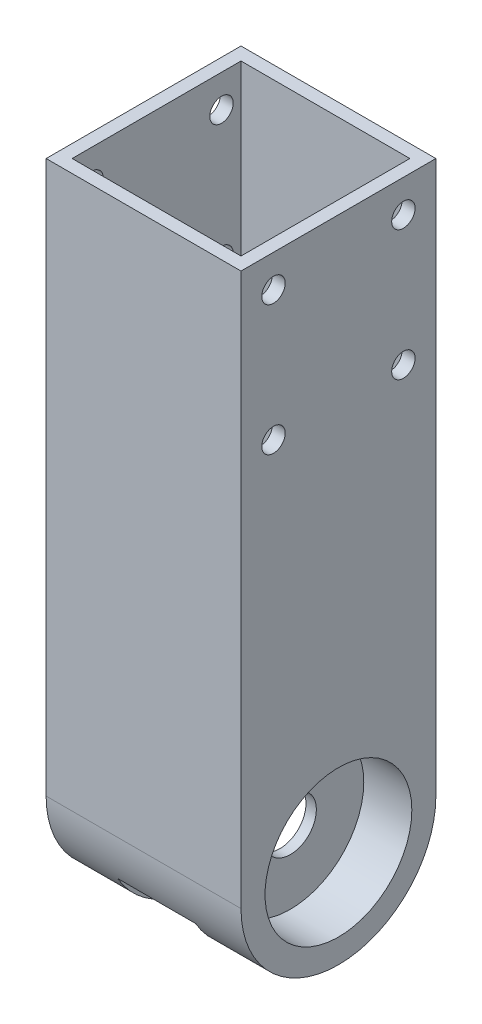
ISO-10303-21;
HEADER;
FILE_DESCRIPTION(('STEP AP214'),'2;1');
FILE_NAME('part.step','',(''),(''),'','','');
FILE_SCHEMA(('AUTOMOTIVE_DESIGN { 1 0 10303 214 1 1 1 1 }'));
ENDSEC;
DATA;
#1=APPLICATION_CONTEXT('core data for automotive mechanical design processes');
#2=APPLICATION_PROTOCOL_DEFINITION('international standard','automotive_design',2000,#1);
#3=PRODUCT_CONTEXT('',#1,'mechanical');
#4=PRODUCT('Part','Part','',(#3));
#5=PRODUCT_RELATED_PRODUCT_CATEGORY('part','',(#4));
#6=PRODUCT_DEFINITION_FORMATION('','',#4);
#7=PRODUCT_DEFINITION_CONTEXT('part definition',#1,'design');
#8=PRODUCT_DEFINITION('design','',#6,#7);
#9=PRODUCT_DEFINITION_SHAPE('','',#8);
#10=(LENGTH_UNIT() NAMED_UNIT(*) SI_UNIT(.MILLI.,.METRE.));
#11=(NAMED_UNIT(*) PLANE_ANGLE_UNIT() SI_UNIT($,.RADIAN.));
#12=(NAMED_UNIT(*) SI_UNIT($,.STERADIAN.) SOLID_ANGLE_UNIT());
#13=UNCERTAINTY_MEASURE_WITH_UNIT(LENGTH_MEASURE(1.E-05),#10,'distance_accuracy_value','');
#14=(GEOMETRIC_REPRESENTATION_CONTEXT(3) GLOBAL_UNCERTAINTY_ASSIGNED_CONTEXT((#13)) GLOBAL_UNIT_ASSIGNED_CONTEXT((#10,
#11,#12)) REPRESENTATION_CONTEXT('',''));
#15=CARTESIAN_POINT('',(0.,0.,0.));
#16=DIRECTION('',(0.,0.,1.));
#17=DIRECTION('',(1.,0.,0.));
#18=AXIS2_PLACEMENT_3D('',#15,#16,#17);
#19=CARTESIAN_POINT('',(-35.,15.,0.));
#20=DIRECTION('',(1.,0.,0.));
#21=DIRECTION('',(0.,0.,-1.));
#22=AXIS2_PLACEMENT_3D('',#19,#20,#21);
#23=CYLINDRICAL_SURFACE('',#22,4.);
#24=CARTESIAN_POINT('',(-6.,15.,0.));
#25=DIRECTION('',(1.,0.,0.));
#26=DIRECTION('',(0.,0.,-1.));
#27=AXIS2_PLACEMENT_3D('',#24,#25,#26);
#28=CIRCLE('',#27,4.);
#29=CARTESIAN_POINT('',(-6.,15.,-4.));
#30=VERTEX_POINT('',#29);
#31=EDGE_CURVE('E228',#30,#30,#28,.T.);
#32=ORIENTED_EDGE('',*,*,#31,.T.);
#33=EDGE_LOOP('',(#32));
#34=FACE_BOUND('',#33,.T.);
#35=CARTESIAN_POINT('',(-7.6,15.,0.));
#36=DIRECTION('',(-1.,0.,0.));
#37=DIRECTION('',(0.,0.,1.));
#38=AXIS2_PLACEMENT_3D('',#35,#36,#37);
#39=CIRCLE('',#38,4.);
#40=CARTESIAN_POINT('',(-7.6,15.,4.));
#41=VERTEX_POINT('',#40);
#42=EDGE_CURVE('E235',#41,#41,#39,.F.);
#43=ORIENTED_EDGE('',*,*,#42,.F.);
#44=EDGE_LOOP('',(#43));
#45=FACE_BOUND('',#44,.T.);
#46=ADVANCED_FACE('F43',(#34,#45),#23,.F.);
#47=CARTESIAN_POINT('',(6.,15.,0.));
#48=DIRECTION('',(-1.,0.,0.));
#49=DIRECTION('',(0.,0.,1.));
#50=AXIS2_PLACEMENT_3D('',#47,#48,#49);
#51=CIRCLE('',#50,4.);
#52=CARTESIAN_POINT('',(6.,15.,4.));
#53=VERTEX_POINT('',#52);
#54=EDGE_CURVE('E224',#53,#53,#51,.T.);
#55=ORIENTED_EDGE('',*,*,#54,.T.);
#56=EDGE_LOOP('',(#55));
#57=FACE_BOUND('',#56,.T.);
#58=CARTESIAN_POINT('',(7.6,15.,0.));
#59=DIRECTION('',(1.,0.,0.));
#60=DIRECTION('',(0.,0.,-1.));
#61=AXIS2_PLACEMENT_3D('',#58,#59,#60);
#62=CIRCLE('',#61,4.);
#63=CARTESIAN_POINT('',(7.6,15.,-4.));
#64=VERTEX_POINT('',#63);
#65=EDGE_CURVE('E231',#64,#64,#62,.F.);
#66=ORIENTED_EDGE('',*,*,#65,.F.);
#67=EDGE_LOOP('',(#66));
#68=FACE_BOUND('',#67,.T.);
#69=ADVANCED_FACE('F379',(#57,#68),#23,.F.);
#70=CARTESIAN_POINT('',(6.,100.,13.));
#71=DIRECTION('',(-1.,0.,0.));
#72=DIRECTION('',(0.,0.,1.));
#73=AXIS2_PLACEMENT_3D('',#70,#71,#72);
#74=PLANE('',#73);
#75=ORIENTED_EDGE('',*,*,#54,.F.);
#76=EDGE_LOOP('',(#75));
#77=FACE_BOUND('',#76,.T.);
#78=DIRECTION('',(0.,-1.,0.));
#79=VECTOR('',#78,1.);
#80=CARTESIAN_POINT('',(6.,100.,-13.));
#81=LINE('',#80,#79);
#82=CARTESIAN_POINT('',(6.,30.,-13.));
#83=VERTEX_POINT('',#82);
#84=CARTESIAN_POINT('',(6.,7.51668522645211,-13.));
#85=VERTEX_POINT('',#84);
#86=EDGE_CURVE('E172',#83,#85,#81,.T.);
#87=ORIENTED_EDGE('',*,*,#86,.T.);
#88=CARTESIAN_POINT('',(6.,15.,0.));
#89=DIRECTION('',(-1.,0.,0.));
#90=DIRECTION('',(0.,0.,1.));
#91=AXIS2_PLACEMENT_3D('',#88,#89,#90);
#92=CIRCLE('',#91,15.);
#93=CARTESIAN_POINT('',(6.,0.,0.));
#94=VERTEX_POINT('',#93);
#95=EDGE_CURVE('E214',#85,#94,#92,.T.);
#96=ORIENTED_EDGE('',*,*,#95,.T.);
#97=CARTESIAN_POINT('',(6.,15.,0.));
#98=DIRECTION('',(-1.,0.,0.));
#99=DIRECTION('',(0.,0.,1.));
#100=AXIS2_PLACEMENT_3D('',#97,#98,#99);
#101=CIRCLE('',#100,15.);
#102=CARTESIAN_POINT('',(6.,7.51668522645212,13.));
#103=VERTEX_POINT('',#102);
#104=EDGE_CURVE('E212',#94,#103,#101,.T.);
#105=ORIENTED_EDGE('',*,*,#104,.T.);
#106=DIRECTION('',(0.,-1.,0.));
#107=VECTOR('',#106,1.);
#108=CARTESIAN_POINT('',(6.,100.,13.));
#109=LINE('',#108,#107);
#110=CARTESIAN_POINT('',(6.,30.,13.));
#111=VERTEX_POINT('',#110);
#112=EDGE_CURVE('E178',#111,#103,#109,.T.);
#113=ORIENTED_EDGE('',*,*,#112,.F.);
#114=DIRECTION('',(0.,0.,1.));
#115=VECTOR('',#114,1.);
#116=CARTESIAN_POINT('',(6.,30.,-13.));
#117=LINE('',#116,#115);
#118=EDGE_CURVE('E310',#83,#111,#117,.T.);
#119=ORIENTED_EDGE('',*,*,#118,.F.);
#120=EDGE_LOOP('',(#87,#96,#105,#113,#119));
#121=FACE_BOUND('',#120,.T.);
#122=ADVANCED_FACE('F347',(#77,#121),#74,.T.);
#123=CARTESIAN_POINT('',(0.,100.,0.));
#124=DIRECTION('',(0.,-1.,0.));
#125=DIRECTION('',(0.,0.,-1.));
#126=AXIS2_PLACEMENT_3D('',#123,#124,#125);
#127=PLANE('',#126);
#128=DIRECTION('',(0.,0.,-1.));
#129=VECTOR('',#128,1.);
#130=CARTESIAN_POINT('',(15.,100.,15.));
#131=LINE('',#130,#129);
#132=CARTESIAN_POINT('',(15.,100.,15.));
#133=VERTEX_POINT('',#132);
#134=CARTESIAN_POINT('',(15.,100.,-15.));
#135=VERTEX_POINT('',#134);
#136=EDGE_CURVE('E176',#133,#135,#131,.T.);
#137=ORIENTED_EDGE('',*,*,#136,.T.);
#138=DIRECTION('',(-1.,0.,0.));
#139=VECTOR('',#138,1.);
#140=CARTESIAN_POINT('',(-15.,100.,-15.));
#141=LINE('',#140,#139);
#142=CARTESIAN_POINT('',(-15.,100.,-15.));
#143=VERTEX_POINT('',#142);
#144=EDGE_CURVE('E184',#135,#143,#141,.T.);
#145=ORIENTED_EDGE('',*,*,#144,.T.);
#146=DIRECTION('',(0.,0.,1.));
#147=VECTOR('',#146,1.);
#148=CARTESIAN_POINT('',(-15.,100.,15.));
#149=LINE('',#148,#147);
#150=CARTESIAN_POINT('',(-15.,100.,15.));
#151=VERTEX_POINT('',#150);
#152=EDGE_CURVE('E186',#143,#151,#149,.T.);
#153=ORIENTED_EDGE('',*,*,#152,.T.);
#154=DIRECTION('',(1.,0.,0.));
#155=VECTOR('',#154,1.);
#156=CARTESIAN_POINT('',(-15.,100.,15.));
#157=LINE('',#156,#155);
#158=EDGE_CURVE('E188',#151,#133,#157,.T.);
#159=ORIENTED_EDGE('',*,*,#158,.T.);
#160=EDGE_LOOP('',(#137,#145,#153,#159));
#161=FACE_BOUND('',#160,.T.);
#162=DIRECTION('',(1.,0.,0.));
#163=VECTOR('',#162,1.);
#164=CARTESIAN_POINT('',(-6.,100.,13.));
#165=LINE('',#164,#163);
#166=CARTESIAN_POINT('',(-13.,100.,13.));
#167=VERTEX_POINT('',#166);
#168=CARTESIAN_POINT('',(13.,100.,13.));
#169=VERTEX_POINT('',#168);
#170=EDGE_CURVE('E320',#167,#169,#165,.T.);
#171=ORIENTED_EDGE('',*,*,#170,.F.);
#172=DIRECTION('',(0.,0.,1.));
#173=VECTOR('',#172,1.);
#174=CARTESIAN_POINT('',(-13.,100.,-13.));
#175=LINE('',#174,#173);
#176=CARTESIAN_POINT('',(-13.,100.,-13.));
#177=VERTEX_POINT('',#176);
#178=EDGE_CURVE('E166',#177,#167,#175,.T.);
#179=ORIENTED_EDGE('',*,*,#178,.F.);
#180=DIRECTION('',(-1.,0.,0.));
#181=VECTOR('',#180,1.);
#182=CARTESIAN_POINT('',(-6.,100.,-13.));
#183=LINE('',#182,#181);
#184=CARTESIAN_POINT('',(13.,100.,-13.));
#185=VERTEX_POINT('',#184);
#186=EDGE_CURVE('E300',#185,#177,#183,.T.);
#187=ORIENTED_EDGE('',*,*,#186,.F.);
#188=DIRECTION('',(0.,0.,-1.));
#189=VECTOR('',#188,1.);
#190=CARTESIAN_POINT('',(13.,100.,-13.));
#191=LINE('',#190,#189);
#192=EDGE_CURVE('E296',#169,#185,#191,.T.);
#193=ORIENTED_EDGE('',*,*,#192,.F.);
#194=EDGE_LOOP('',(#171,#179,#187,#193));
#195=FACE_BOUND('',#194,.T.);
#196=ADVANCED_FACE('F338',(#161,#195),#127,.F.);
#197=CARTESIAN_POINT('',(15.,100.,15.));
#198=DIRECTION('',(-1.,0.,0.));
#199=DIRECTION('',(0.,0.,1.));
#200=AXIS2_PLACEMENT_3D('',#197,#198,#199);
#201=PLANE('',#200);
#202=CARTESIAN_POINT('',(15.,75.,10.));
#203=DIRECTION('',(1.,0.,0.));
#204=DIRECTION('',(0.,0.,-1.));
#205=AXIS2_PLACEMENT_3D('',#202,#203,#204);
#206=CIRCLE('',#205,1.8);
#207=CARTESIAN_POINT('',(15.,75.,8.2));
#208=VERTEX_POINT('',#207);
#209=EDGE_CURVE('E652',#208,#208,#206,.T.);
#210=ORIENTED_EDGE('',*,*,#209,.F.);
#211=EDGE_LOOP('',(#210));
#212=FACE_BOUND('',#211,.T.);
#213=CARTESIAN_POINT('',(15.,75.,-10.));
#214=DIRECTION('',(1.,0.,0.));
#215=DIRECTION('',(0.,0.,-1.));
#216=AXIS2_PLACEMENT_3D('',#213,#214,#215);
#217=CIRCLE('',#216,1.8);
#218=CARTESIAN_POINT('',(15.,75.,-11.8));
#219=VERTEX_POINT('',#218);
#220=EDGE_CURVE('E259',#219,#219,#217,.T.);
#221=ORIENTED_EDGE('',*,*,#220,.F.);
#222=EDGE_LOOP('',(#221));
#223=FACE_BOUND('',#222,.T.);
#224=CARTESIAN_POINT('',(15.,95.,-10.));
#225=DIRECTION('',(1.,0.,0.));
#226=DIRECTION('',(0.,0.,-1.));
#227=AXIS2_PLACEMENT_3D('',#224,#225,#226);
#228=CIRCLE('',#227,1.8);
#229=CARTESIAN_POINT('',(15.,95.,-11.8));
#230=VERTEX_POINT('',#229);
#231=EDGE_CURVE('E256',#230,#230,#228,.T.);
#232=ORIENTED_EDGE('',*,*,#231,.F.);
#233=EDGE_LOOP('',(#232));
#234=FACE_BOUND('',#233,.T.);
#235=CARTESIAN_POINT('',(15.,95.,10.));
#236=DIRECTION('',(1.,0.,0.));
#237=DIRECTION('',(0.,0.,-1.));
#238=AXIS2_PLACEMENT_3D('',#235,#236,#237);
#239=CIRCLE('',#238,1.8);
#240=CARTESIAN_POINT('',(15.,95.,8.2));
#241=VERTEX_POINT('',#240);
#242=EDGE_CURVE('E274',#241,#241,#239,.T.);
#243=ORIENTED_EDGE('',*,*,#242,.F.);
#244=EDGE_LOOP('',(#243));
#245=FACE_BOUND('',#244,.T.);
#246=CARTESIAN_POINT('',(15.,15.,0.));
#247=DIRECTION('',(1.,0.,0.));
#248=DIRECTION('',(0.,0.,-1.));
#249=AXIS2_PLACEMENT_3D('',#246,#247,#248);
#250=CIRCLE('',#249,11.3);
#251=CARTESIAN_POINT('',(15.,15.,-11.3));
#252=VERTEX_POINT('',#251);
#253=EDGE_CURVE('E238',#252,#252,#250,.T.);
#254=ORIENTED_EDGE('',*,*,#253,.F.);
#255=EDGE_LOOP('',(#254));
#256=FACE_BOUND('',#255,.T.);
#257=CARTESIAN_POINT('',(15.,15.,0.));
#258=DIRECTION('',(-1.,0.,0.));
#259=DIRECTION('',(0.,0.,1.));
#260=AXIS2_PLACEMENT_3D('',#257,#258,#259);
#261=CIRCLE('',#260,15.);
#262=CARTESIAN_POINT('',(15.,15.,15.));
#263=VERTEX_POINT('',#262);
#264=CARTESIAN_POINT('',(15.,0.,0.));
#265=VERTEX_POINT('',#264);
#266=EDGE_CURVE('E66',#263,#265,#261,.F.);
#267=ORIENTED_EDGE('',*,*,#266,.T.);
#268=CARTESIAN_POINT('',(15.,15.,0.));
#269=DIRECTION('',(-1.,0.,0.));
#270=DIRECTION('',(0.,0.,1.));
#271=AXIS2_PLACEMENT_3D('',#268,#269,#270);
#272=CIRCLE('',#271,15.);
#273=CARTESIAN_POINT('',(15.,15.,-15.));
#274=VERTEX_POINT('',#273);
#275=EDGE_CURVE('E217',#265,#274,#272,.F.);
#276=ORIENTED_EDGE('',*,*,#275,.T.);
#277=DIRECTION('',(0.,-1.,0.));
#278=VECTOR('',#277,1.);
#279=CARTESIAN_POINT('',(15.,100.,-15.));
#280=LINE('',#279,#278);
#281=EDGE_CURVE('E197',#135,#274,#280,.T.);
#282=ORIENTED_EDGE('',*,*,#281,.F.);
#283=ORIENTED_EDGE('',*,*,#136,.F.);
#284=DIRECTION('',(0.,-1.,0.));
#285=VECTOR('',#284,1.);
#286=CARTESIAN_POINT('',(15.,100.,15.));
#287=LINE('',#286,#285);
#288=EDGE_CURVE('E190',#133,#263,#287,.T.);
#289=ORIENTED_EDGE('',*,*,#288,.T.);
#290=EDGE_LOOP('',(#267,#276,#282,#283,#289));
#291=FACE_BOUND('',#290,.T.);
#292=ADVANCED_FACE('F364',(#212,#223,#234,#245,#256,#291),#201,.F.);
#293=CARTESIAN_POINT('',(-15.,100.,-15.));
#294=DIRECTION('',(0.,0.,1.));
#295=DIRECTION('',(1.,0.,0.));
#296=AXIS2_PLACEMENT_3D('',#293,#294,#295);
#297=PLANE('',#296);
#298=ORIENTED_EDGE('',*,*,#281,.T.);
#299=DIRECTION('',(-1.,0.,0.));
#300=VECTOR('',#299,1.);
#301=CARTESIAN_POINT('',(-15.,15.,-15.));
#302=LINE('',#301,#300);
#303=CARTESIAN_POINT('',(-15.,15.,-15.));
#304=VERTEX_POINT('',#303);
#305=EDGE_CURVE('E200',#274,#304,#302,.T.);
#306=ORIENTED_EDGE('',*,*,#305,.T.);
#307=DIRECTION('',(0.,-1.,0.));
#308=VECTOR('',#307,1.);
#309=CARTESIAN_POINT('',(-15.,100.,-15.));
#310=LINE('',#309,#308);
#311=EDGE_CURVE('E194',#143,#304,#310,.T.);
#312=ORIENTED_EDGE('',*,*,#311,.F.);
#313=ORIENTED_EDGE('',*,*,#144,.F.);
#314=EDGE_LOOP('',(#298,#306,#312,#313));
#315=FACE_BOUND('',#314,.T.);
#316=ADVANCED_FACE('F357',(#315),#297,.F.);
#317=CARTESIAN_POINT('',(-15.,100.,15.));
#318=DIRECTION('',(1.,0.,0.));
#319=DIRECTION('',(0.,0.,-1.));
#320=AXIS2_PLACEMENT_3D('',#317,#318,#319);
#321=PLANE('',#320);
#322=CARTESIAN_POINT('',(-15.,75.,10.));
#323=DIRECTION('',(1.,0.,0.));
#324=DIRECTION('',(0.,0.,-1.));
#325=AXIS2_PLACEMENT_3D('',#322,#323,#324);
#326=CIRCLE('',#325,1.8);
#327=CARTESIAN_POINT('',(-15.,75.,8.2));
#328=VERTEX_POINT('',#327);
#329=EDGE_CURVE('E421',#328,#328,#326,.T.);
#330=ORIENTED_EDGE('',*,*,#329,.T.);
#331=EDGE_LOOP('',(#330));
#332=FACE_BOUND('',#331,.T.);
#333=CARTESIAN_POINT('',(-15.,75.,-10.));
#334=DIRECTION('',(1.,0.,0.));
#335=DIRECTION('',(0.,0.,-1.));
#336=AXIS2_PLACEMENT_3D('',#333,#334,#335);
#337=CIRCLE('',#336,1.8);
#338=CARTESIAN_POINT('',(-15.,75.,-11.8));
#339=VERTEX_POINT('',#338);
#340=EDGE_CURVE('E252',#339,#339,#337,.T.);
#341=ORIENTED_EDGE('',*,*,#340,.T.);
#342=EDGE_LOOP('',(#341));
#343=FACE_BOUND('',#342,.T.);
#344=CARTESIAN_POINT('',(-15.,95.,-10.));
#345=DIRECTION('',(1.,0.,0.));
#346=DIRECTION('',(0.,0.,-1.));
#347=AXIS2_PLACEMENT_3D('',#344,#345,#346);
#348=CIRCLE('',#347,1.8);
#349=CARTESIAN_POINT('',(-15.,95.,-11.8));
#350=VERTEX_POINT('',#349);
#351=EDGE_CURVE('E248',#350,#350,#348,.T.);
#352=ORIENTED_EDGE('',*,*,#351,.T.);
#353=EDGE_LOOP('',(#352));
#354=FACE_BOUND('',#353,.T.);
#355=CARTESIAN_POINT('',(-15.,95.,10.));
#356=DIRECTION('',(1.,0.,0.));
#357=DIRECTION('',(0.,0.,-1.));
#358=AXIS2_PLACEMENT_3D('',#355,#356,#357);
#359=CIRCLE('',#358,1.8);
#360=CARTESIAN_POINT('',(-15.,95.,8.2));
#361=VERTEX_POINT('',#360);
#362=EDGE_CURVE('E244',#361,#361,#359,.T.);
#363=ORIENTED_EDGE('',*,*,#362,.T.);
#364=EDGE_LOOP('',(#363));
#365=FACE_BOUND('',#364,.T.);
#366=CARTESIAN_POINT('',(-15.,15.,0.));
#367=DIRECTION('',(-1.,0.,0.));
#368=DIRECTION('',(0.,0.,1.));
#369=AXIS2_PLACEMENT_3D('',#366,#367,#368);
#370=CIRCLE('',#369,11.3);
#371=CARTESIAN_POINT('',(-15.,15.,11.3));
#372=VERTEX_POINT('',#371);
#373=EDGE_CURVE('E281',#372,#372,#370,.T.);
#374=ORIENTED_EDGE('',*,*,#373,.F.);
#375=EDGE_LOOP('',(#374));
#376=FACE_BOUND('',#375,.T.);
#377=ORIENTED_EDGE('',*,*,#311,.T.);
#378=CARTESIAN_POINT('',(-15.,15.,0.));
#379=DIRECTION('',(1.,0.,0.));
#380=DIRECTION('',(0.,0.,-1.));
#381=AXIS2_PLACEMENT_3D('',#378,#379,#380);
#382=CIRCLE('',#381,15.);
#383=CARTESIAN_POINT('',(-15.,0.,0.));
#384=VERTEX_POINT('',#383);
#385=EDGE_CURVE('E205',#304,#384,#382,.F.);
#386=ORIENTED_EDGE('',*,*,#385,.T.);
#387=CARTESIAN_POINT('',(-15.,15.,0.));
#388=DIRECTION('',(1.,0.,0.));
#389=DIRECTION('',(0.,0.,-1.));
#390=AXIS2_PLACEMENT_3D('',#387,#388,#389);
#391=CIRCLE('',#390,15.);
#392=CARTESIAN_POINT('',(-15.,15.,15.));
#393=VERTEX_POINT('',#392);
#394=EDGE_CURVE('E203',#384,#393,#391,.F.);
#395=ORIENTED_EDGE('',*,*,#394,.T.);
#396=DIRECTION('',(0.,-1.,0.));
#397=VECTOR('',#396,1.);
#398=CARTESIAN_POINT('',(-15.,100.,15.));
#399=LINE('',#398,#397);
#400=EDGE_CURVE('E192',#151,#393,#399,.T.);
#401=ORIENTED_EDGE('',*,*,#400,.F.);
#402=ORIENTED_EDGE('',*,*,#152,.F.);
#403=EDGE_LOOP('',(#377,#386,#395,#401,#402));
#404=FACE_BOUND('',#403,.T.);
#405=ADVANCED_FACE('F360',(#332,#343,#354,#365,#376,#404),#321,.F.);
#406=CARTESIAN_POINT('',(-15.,100.,15.));
#407=DIRECTION('',(0.,0.,-1.));
#408=DIRECTION('',(-1.,0.,0.));
#409=AXIS2_PLACEMENT_3D('',#406,#407,#408);
#410=PLANE('',#409);
#411=ORIENTED_EDGE('',*,*,#400,.T.);
#412=DIRECTION('',(1.,0.,0.));
#413=VECTOR('',#412,1.);
#414=CARTESIAN_POINT('',(15.,15.,15.));
#415=LINE('',#414,#413);
#416=EDGE_CURVE('E52',#393,#263,#415,.T.);
#417=ORIENTED_EDGE('',*,*,#416,.T.);
#418=ORIENTED_EDGE('',*,*,#288,.F.);
#419=ORIENTED_EDGE('',*,*,#158,.F.);
#420=EDGE_LOOP('',(#411,#417,#418,#419));
#421=FACE_BOUND('',#420,.T.);
#422=ADVANCED_FACE('F410',(#421),#410,.F.);
#423=CARTESIAN_POINT('',(-6.,100.,-13.));
#424=DIRECTION('',(0.,0.,1.));
#425=DIRECTION('',(1.,0.,0.));
#426=AXIS2_PLACEMENT_3D('',#423,#424,#425);
#427=PLANE('',#426);
#428=DIRECTION('',(0.,-1.,0.));
#429=VECTOR('',#428,1.);
#430=CARTESIAN_POINT('',(-6.,100.,-13.));
#431=LINE('',#430,#429);
#432=CARTESIAN_POINT('',(-6.,30.,-13.));
#433=VERTEX_POINT('',#432);
#434=CARTESIAN_POINT('',(-6.,7.51668522645212,-13.));
#435=VERTEX_POINT('',#434);
#436=EDGE_CURVE('E150',#433,#435,#431,.T.);
#437=ORIENTED_EDGE('',*,*,#436,.T.);
#438=DIRECTION('',(1.,0.,0.));
#439=VECTOR('',#438,1.);
#440=CARTESIAN_POINT('',(-6.,7.51668522645211,-13.));
#441=LINE('',#440,#439);
#442=EDGE_CURVE('E210',#435,#85,#441,.T.);
#443=ORIENTED_EDGE('',*,*,#442,.T.);
#444=ORIENTED_EDGE('',*,*,#86,.F.);
#445=DIRECTION('',(-1.,0.,0.));
#446=VECTOR('',#445,1.);
#447=CARTESIAN_POINT('',(6.,30.,-13.));
#448=LINE('',#447,#446);
#449=CARTESIAN_POINT('',(13.,30.,-13.));
#450=VERTEX_POINT('',#449);
#451=EDGE_CURVE('E305',#450,#83,#448,.T.);
#452=ORIENTED_EDGE('',*,*,#451,.F.);
#453=DIRECTION('',(0.,1.,0.));
#454=VECTOR('',#453,1.);
#455=CARTESIAN_POINT('',(13.,30.,-13.));
#456=LINE('',#455,#454);
#457=EDGE_CURVE('E227',#450,#185,#456,.T.);
#458=ORIENTED_EDGE('',*,*,#457,.T.);
#459=ORIENTED_EDGE('',*,*,#186,.T.);
#460=DIRECTION('',(0.,1.,0.));
#461=VECTOR('',#460,1.);
#462=CARTESIAN_POINT('',(-13.,30.,-13.));
#463=LINE('',#462,#461);
#464=CARTESIAN_POINT('',(-13.,30.,-13.));
#465=VERTEX_POINT('',#464);
#466=EDGE_CURVE('E152',#465,#177,#463,.T.);
#467=ORIENTED_EDGE('',*,*,#466,.F.);
#468=DIRECTION('',(-1.,0.,0.));
#469=VECTOR('',#468,1.);
#470=CARTESIAN_POINT('',(-6.,30.,-13.));
#471=LINE('',#470,#469);
#472=EDGE_CURVE('E146',#433,#465,#471,.T.);
#473=ORIENTED_EDGE('',*,*,#472,.F.);
#474=EDGE_LOOP('',(#437,#443,#444,#452,#458,#459,#467,#473));
#475=FACE_BOUND('',#474,.T.);
#476=ADVANCED_FACE('F148',(#475),#427,.T.);
#477=CARTESIAN_POINT('',(-6.,100.,13.));
#478=DIRECTION('',(1.,0.,0.));
#479=DIRECTION('',(0.,0.,-1.));
#480=AXIS2_PLACEMENT_3D('',#477,#478,#479);
#481=PLANE('',#480);
#482=ORIENTED_EDGE('',*,*,#31,.F.);
#483=EDGE_LOOP('',(#482));
#484=FACE_BOUND('',#483,.T.);
#485=CARTESIAN_POINT('',(-6.,15.,0.));
#486=DIRECTION('',(1.,0.,0.));
#487=DIRECTION('',(0.,0.,-1.));
#488=AXIS2_PLACEMENT_3D('',#485,#486,#487);
#489=CIRCLE('',#488,15.);
#490=CARTESIAN_POINT('',(-6.,7.51668522645212,13.));
#491=VERTEX_POINT('',#490);
#492=CARTESIAN_POINT('',(-6.,0.,0.));
#493=VERTEX_POINT('',#492);
#494=EDGE_CURVE('E207',#491,#493,#489,.T.);
#495=ORIENTED_EDGE('',*,*,#494,.T.);
#496=CARTESIAN_POINT('',(-6.,15.,0.));
#497=DIRECTION('',(1.,0.,0.));
#498=DIRECTION('',(0.,0.,-1.));
#499=AXIS2_PLACEMENT_3D('',#496,#497,#498);
#500=CIRCLE('',#499,15.);
#501=EDGE_CURVE('E171',#493,#435,#500,.T.);
#502=ORIENTED_EDGE('',*,*,#501,.T.);
#503=ORIENTED_EDGE('',*,*,#436,.F.);
#504=DIRECTION('',(0.,0.,-1.));
#505=VECTOR('',#504,1.);
#506=CARTESIAN_POINT('',(-6.,30.,-13.));
#507=LINE('',#506,#505);
#508=CARTESIAN_POINT('',(-6.,30.,13.));
#509=VERTEX_POINT('',#508);
#510=EDGE_CURVE('E157',#509,#433,#507,.T.);
#511=ORIENTED_EDGE('',*,*,#510,.F.);
#512=DIRECTION('',(0.,-1.,0.));
#513=VECTOR('',#512,1.);
#514=CARTESIAN_POINT('',(-6.,100.,13.));
#515=LINE('',#514,#513);
#516=EDGE_CURVE('E173',#509,#491,#515,.T.);
#517=ORIENTED_EDGE('',*,*,#516,.T.);
#518=EDGE_LOOP('',(#495,#502,#503,#511,#517));
#519=FACE_BOUND('',#518,.T.);
#520=ADVANCED_FACE('F169',(#484,#519),#481,.T.);
#521=CARTESIAN_POINT('',(-6.,100.,13.));
#522=DIRECTION('',(0.,0.,-1.));
#523=DIRECTION('',(-1.,0.,0.));
#524=AXIS2_PLACEMENT_3D('',#521,#522,#523);
#525=PLANE('',#524);
#526=ORIENTED_EDGE('',*,*,#112,.T.);
#527=DIRECTION('',(-1.,0.,0.));
#528=VECTOR('',#527,1.);
#529=CARTESIAN_POINT('',(6.,7.51668522645212,13.));
#530=LINE('',#529,#528);
#531=EDGE_CURVE('E11',#103,#491,#530,.T.);
#532=ORIENTED_EDGE('',*,*,#531,.T.);
#533=ORIENTED_EDGE('',*,*,#516,.F.);
#534=DIRECTION('',(1.,0.,0.));
#535=VECTOR('',#534,1.);
#536=CARTESIAN_POINT('',(-6.,30.,13.));
#537=LINE('',#536,#535);
#538=CARTESIAN_POINT('',(-13.,30.,13.));
#539=VERTEX_POINT('',#538);
#540=EDGE_CURVE('E162',#539,#509,#537,.T.);
#541=ORIENTED_EDGE('',*,*,#540,.F.);
#542=DIRECTION('',(0.,1.,0.));
#543=VECTOR('',#542,1.);
#544=CARTESIAN_POINT('',(-13.,30.,13.));
#545=LINE('',#544,#543);
#546=EDGE_CURVE('E297',#539,#167,#545,.T.);
#547=ORIENTED_EDGE('',*,*,#546,.T.);
#548=ORIENTED_EDGE('',*,*,#170,.T.);
#549=DIRECTION('',(0.,1.,0.));
#550=VECTOR('',#549,1.);
#551=CARTESIAN_POINT('',(13.,30.,13.));
#552=LINE('',#551,#550);
#553=CARTESIAN_POINT('',(13.,30.,13.));
#554=VERTEX_POINT('',#553);
#555=EDGE_CURVE('E302',#554,#169,#552,.T.);
#556=ORIENTED_EDGE('',*,*,#555,.F.);
#557=DIRECTION('',(1.,0.,0.));
#558=VECTOR('',#557,1.);
#559=CARTESIAN_POINT('',(6.,30.,13.));
#560=LINE('',#559,#558);
#561=EDGE_CURVE('E315',#111,#554,#560,.T.);
#562=ORIENTED_EDGE('',*,*,#561,.F.);
#563=EDGE_LOOP('',(#526,#532,#533,#541,#547,#548,#556,#562));
#564=FACE_BOUND('',#563,.T.);
#565=ADVANCED_FACE('F326',(#564),#525,.T.);
#566=CARTESIAN_POINT('',(13.,30.,-13.));
#567=DIRECTION('',(1.,0.,0.));
#568=DIRECTION('',(0.,0.,-1.));
#569=AXIS2_PLACEMENT_3D('',#566,#567,#568);
#570=PLANE('',#569);
#571=CARTESIAN_POINT('',(13.,75.,10.));
#572=DIRECTION('',(1.,0.,0.));
#573=DIRECTION('',(0.,0.,-1.));
#574=AXIS2_PLACEMENT_3D('',#571,#572,#573);
#575=CIRCLE('',#574,1.8);
#576=CARTESIAN_POINT('',(13.,75.,8.2));
#577=VERTEX_POINT('',#576);
#578=EDGE_CURVE('E264',#577,#577,#575,.T.);
#579=ORIENTED_EDGE('',*,*,#578,.T.);
#580=EDGE_LOOP('',(#579));
#581=FACE_BOUND('',#580,.T.);
#582=CARTESIAN_POINT('',(13.,75.,-10.));
#583=DIRECTION('',(1.,0.,0.));
#584=DIRECTION('',(0.,0.,-1.));
#585=AXIS2_PLACEMENT_3D('',#582,#583,#584);
#586=CIRCLE('',#585,1.8);
#587=CARTESIAN_POINT('',(13.,75.,-11.8));
#588=VERTEX_POINT('',#587);
#589=EDGE_CURVE('E251',#588,#588,#586,.T.);
#590=ORIENTED_EDGE('',*,*,#589,.T.);
#591=EDGE_LOOP('',(#590));
#592=FACE_BOUND('',#591,.T.);
#593=CARTESIAN_POINT('',(13.,95.,-10.));
#594=DIRECTION('',(1.,0.,0.));
#595=DIRECTION('',(0.,0.,-1.));
#596=AXIS2_PLACEMENT_3D('',#593,#594,#595);
#597=CIRCLE('',#596,1.8);
#598=CARTESIAN_POINT('',(13.,95.,-11.8));
#599=VERTEX_POINT('',#598);
#600=EDGE_CURVE('E247',#599,#599,#597,.T.);
#601=ORIENTED_EDGE('',*,*,#600,.T.);
#602=EDGE_LOOP('',(#601));
#603=FACE_BOUND('',#602,.T.);
#604=CARTESIAN_POINT('',(13.,95.,10.));
#605=DIRECTION('',(1.,0.,0.));
#606=DIRECTION('',(0.,0.,-1.));
#607=AXIS2_PLACEMENT_3D('',#604,#605,#606);
#608=CIRCLE('',#607,1.8);
#609=CARTESIAN_POINT('',(13.,95.,8.2));
#610=VERTEX_POINT('',#609);
#611=EDGE_CURVE('E243',#610,#610,#608,.T.);
#612=ORIENTED_EDGE('',*,*,#611,.T.);
#613=EDGE_LOOP('',(#612));
#614=FACE_BOUND('',#613,.T.);
#615=ORIENTED_EDGE('',*,*,#192,.T.);
#616=ORIENTED_EDGE('',*,*,#457,.F.);
#617=DIRECTION('',(0.,0.,-1.));
#618=VECTOR('',#617,1.);
#619=CARTESIAN_POINT('',(13.,30.,-13.));
#620=LINE('',#619,#618);
#621=EDGE_CURVE('E312',#554,#450,#620,.T.);
#622=ORIENTED_EDGE('',*,*,#621,.F.);
#623=ORIENTED_EDGE('',*,*,#555,.T.);
#624=EDGE_LOOP('',(#615,#616,#622,#623));
#625=FACE_BOUND('',#624,.T.);
#626=ADVANCED_FACE('F341',(#581,#592,#603,#614,#625),#570,.F.);
#627=CARTESIAN_POINT('',(0.,30.,0.));
#628=DIRECTION('',(0.,1.,0.));
#629=DIRECTION('',(0.,0.,1.));
#630=AXIS2_PLACEMENT_3D('',#627,#628,#629);
#631=PLANE('',#630);
#632=ORIENTED_EDGE('',*,*,#118,.T.);
#633=ORIENTED_EDGE('',*,*,#561,.T.);
#634=ORIENTED_EDGE('',*,*,#621,.T.);
#635=ORIENTED_EDGE('',*,*,#451,.T.);
#636=EDGE_LOOP('',(#632,#633,#634,#635));
#637=FACE_BOUND('',#636,.T.);
#638=ADVANCED_FACE('F345',(#637),#631,.T.);
#639=CARTESIAN_POINT('',(-13.,30.,-13.));
#640=DIRECTION('',(-1.,0.,0.));
#641=DIRECTION('',(0.,0.,1.));
#642=AXIS2_PLACEMENT_3D('',#639,#640,#641);
#643=PLANE('',#642);
#644=CARTESIAN_POINT('',(-13.,75.,10.));
#645=DIRECTION('',(-1.,0.,0.));
#646=DIRECTION('',(0.,0.,1.));
#647=AXIS2_PLACEMENT_3D('',#644,#645,#646);
#648=CIRCLE('',#647,1.8);
#649=CARTESIAN_POINT('',(-13.,75.,11.8));
#650=VERTEX_POINT('',#649);
#651=EDGE_CURVE('E47',#650,#650,#648,.T.);
#652=ORIENTED_EDGE('',*,*,#651,.T.);
#653=EDGE_LOOP('',(#652));
#654=FACE_BOUND('',#653,.T.);
#655=CARTESIAN_POINT('',(-13.,75.,-10.));
#656=DIRECTION('',(-1.,0.,0.));
#657=DIRECTION('',(0.,0.,1.));
#658=AXIS2_PLACEMENT_3D('',#655,#656,#657);
#659=CIRCLE('',#658,1.8);
#660=CARTESIAN_POINT('',(-13.,75.,-8.20000000000001));
#661=VERTEX_POINT('',#660);
#662=EDGE_CURVE('E249',#661,#661,#659,.T.);
#663=ORIENTED_EDGE('',*,*,#662,.T.);
#664=EDGE_LOOP('',(#663));
#665=FACE_BOUND('',#664,.T.);
#666=CARTESIAN_POINT('',(-13.,95.,-10.));
#667=DIRECTION('',(-1.,0.,0.));
#668=DIRECTION('',(0.,0.,1.));
#669=AXIS2_PLACEMENT_3D('',#666,#667,#668);
#670=CIRCLE('',#669,1.8);
#671=CARTESIAN_POINT('',(-13.,95.,-8.20000000000001));
#672=VERTEX_POINT('',#671);
#673=EDGE_CURVE('E245',#672,#672,#670,.T.);
#674=ORIENTED_EDGE('',*,*,#673,.T.);
#675=EDGE_LOOP('',(#674));
#676=FACE_BOUND('',#675,.T.);
#677=CARTESIAN_POINT('',(-13.,95.,10.));
#678=DIRECTION('',(-1.,0.,0.));
#679=DIRECTION('',(0.,0.,1.));
#680=AXIS2_PLACEMENT_3D('',#677,#678,#679);
#681=CIRCLE('',#680,1.8);
#682=CARTESIAN_POINT('',(-13.,95.,11.8));
#683=VERTEX_POINT('',#682);
#684=EDGE_CURVE('E240',#683,#683,#681,.T.);
#685=ORIENTED_EDGE('',*,*,#684,.T.);
#686=EDGE_LOOP('',(#685));
#687=FACE_BOUND('',#686,.T.);
#688=ORIENTED_EDGE('',*,*,#178,.T.);
#689=ORIENTED_EDGE('',*,*,#546,.F.);
#690=DIRECTION('',(0.,0.,1.));
#691=VECTOR('',#690,1.);
#692=CARTESIAN_POINT('',(-13.,30.,-13.));
#693=LINE('',#692,#691);
#694=EDGE_CURVE('E156',#465,#539,#693,.T.);
#695=ORIENTED_EDGE('',*,*,#694,.F.);
#696=ORIENTED_EDGE('',*,*,#466,.T.);
#697=EDGE_LOOP('',(#688,#689,#695,#696));
#698=FACE_BOUND('',#697,.T.);
#699=ADVANCED_FACE('F336',(#654,#665,#676,#687,#698),#643,.F.);
#700=CARTESIAN_POINT('',(0.,30.,0.));
#701=DIRECTION('',(0.,-1.,0.));
#702=DIRECTION('',(0.,0.,-1.));
#703=AXIS2_PLACEMENT_3D('',#700,#701,#702);
#704=PLANE('',#703);
#705=ORIENTED_EDGE('',*,*,#510,.T.);
#706=ORIENTED_EDGE('',*,*,#472,.T.);
#707=ORIENTED_EDGE('',*,*,#694,.T.);
#708=ORIENTED_EDGE('',*,*,#540,.T.);
#709=EDGE_LOOP('',(#705,#706,#707,#708));
#710=FACE_BOUND('',#709,.T.);
#711=ADVANCED_FACE('F160',(#710),#704,.F.);
#712=CARTESIAN_POINT('',(-15.,15.,0.));
#713=DIRECTION('',(-1.,0.,0.));
#714=DIRECTION('',(0.,0.,1.));
#715=AXIS2_PLACEMENT_3D('',#712,#713,#714);
#716=CYLINDRICAL_SURFACE('',#715,15.);
#717=DIRECTION('',(1.,0.,0.));
#718=VECTOR('',#717,1.);
#719=CARTESIAN_POINT('',(-15.,0.,0.));
#720=LINE('',#719,#718);
#721=EDGE_CURVE('E223',#493,#384,#720,.F.);
#722=ORIENTED_EDGE('',*,*,#721,.F.);
#723=ORIENTED_EDGE('',*,*,#494,.F.);
#724=ORIENTED_EDGE('',*,*,#531,.F.);
#725=ORIENTED_EDGE('',*,*,#104,.F.);
#726=DIRECTION('',(1.,0.,0.));
#727=VECTOR('',#726,1.);
#728=CARTESIAN_POINT('',(-15.,0.,0.));
#729=LINE('',#728,#727);
#730=EDGE_CURVE('E220',#265,#94,#729,.F.);
#731=ORIENTED_EDGE('',*,*,#730,.F.);
#732=ORIENTED_EDGE('',*,*,#266,.F.);
#733=ORIENTED_EDGE('',*,*,#416,.F.);
#734=ORIENTED_EDGE('',*,*,#394,.F.);
#735=EDGE_LOOP('',(#722,#723,#724,#725,#731,#732,#733,#734));
#736=FACE_BOUND('',#735,.T.);
#737=ADVANCED_FACE('F45',(#736),#716,.T.);
#738=CARTESIAN_POINT('',(-15.,15.,0.));
#739=DIRECTION('',(1.,0.,0.));
#740=DIRECTION('',(0.,0.,-1.));
#741=AXIS2_PLACEMENT_3D('',#738,#739,#740);
#742=CYLINDRICAL_SURFACE('',#741,15.);
#743=ORIENTED_EDGE('',*,*,#501,.F.);
#744=ORIENTED_EDGE('',*,*,#721,.T.);
#745=ORIENTED_EDGE('',*,*,#385,.F.);
#746=ORIENTED_EDGE('',*,*,#305,.F.);
#747=ORIENTED_EDGE('',*,*,#275,.F.);
#748=ORIENTED_EDGE('',*,*,#730,.T.);
#749=ORIENTED_EDGE('',*,*,#95,.F.);
#750=ORIENTED_EDGE('',*,*,#442,.F.);
#751=EDGE_LOOP('',(#743,#744,#745,#746,#747,#748,#749,#750));
#752=FACE_BOUND('',#751,.T.);
#753=ADVANCED_FACE('F350',(#752),#742,.T.);
#754=CARTESIAN_POINT('',(7.6,15.,0.));
#755=DIRECTION('',(1.,0.,0.));
#756=DIRECTION('',(0.,0.,-1.));
#757=AXIS2_PLACEMENT_3D('',#754,#755,#756);
#758=PLANE('',#757);
#759=CARTESIAN_POINT('',(7.6,15.,0.));
#760=DIRECTION('',(1.,0.,0.));
#761=DIRECTION('',(0.,0.,-1.));
#762=AXIS2_PLACEMENT_3D('',#759,#760,#761);
#763=CIRCLE('',#762,11.3);
#764=CARTESIAN_POINT('',(7.6,15.,-11.3));
#765=VERTEX_POINT('',#764);
#766=EDGE_CURVE('E234',#765,#765,#763,.T.);
#767=ORIENTED_EDGE('',*,*,#766,.T.);
#768=EDGE_LOOP('',(#767));
#769=FACE_BOUND('',#768,.T.);
#770=ORIENTED_EDGE('',*,*,#65,.T.);
#771=EDGE_LOOP('',(#770));
#772=FACE_BOUND('',#771,.T.);
#773=ADVANCED_FACE('F443',(#769,#772),#758,.T.);
#774=CARTESIAN_POINT('',(7.6,15.,0.));
#775=DIRECTION('',(1.,0.,0.));
#776=DIRECTION('',(0.,0.,-1.));
#777=AXIS2_PLACEMENT_3D('',#774,#775,#776);
#778=CYLINDRICAL_SURFACE('',#777,11.3);
#779=ORIENTED_EDGE('',*,*,#766,.F.);
#780=EDGE_LOOP('',(#779));
#781=FACE_BOUND('',#780,.T.);
#782=ORIENTED_EDGE('',*,*,#253,.T.);
#783=EDGE_LOOP('',(#782));
#784=FACE_BOUND('',#783,.T.);
#785=ADVANCED_FACE('F391',(#781,#784),#778,.F.);
#786=CARTESIAN_POINT('',(-7.6,15.,0.));
#787=DIRECTION('',(-1.,0.,0.));
#788=DIRECTION('',(0.,0.,1.));
#789=AXIS2_PLACEMENT_3D('',#786,#787,#788);
#790=PLANE('',#789);
#791=CARTESIAN_POINT('',(-7.6,15.,0.));
#792=DIRECTION('',(-1.,0.,0.));
#793=DIRECTION('',(0.,0.,1.));
#794=AXIS2_PLACEMENT_3D('',#791,#792,#793);
#795=CIRCLE('',#794,11.3);
#796=CARTESIAN_POINT('',(-7.6,15.,11.3));
#797=VERTEX_POINT('',#796);
#798=EDGE_CURVE('E239',#797,#797,#795,.T.);
#799=ORIENTED_EDGE('',*,*,#798,.T.);
#800=EDGE_LOOP('',(#799));
#801=FACE_BOUND('',#800,.T.);
#802=ORIENTED_EDGE('',*,*,#42,.T.);
#803=EDGE_LOOP('',(#802));
#804=FACE_BOUND('',#803,.T.);
#805=ADVANCED_FACE('F431',(#801,#804),#790,.T.);
#806=CARTESIAN_POINT('',(-7.6,15.,0.));
#807=DIRECTION('',(-1.,0.,0.));
#808=DIRECTION('',(0.,0.,1.));
#809=AXIS2_PLACEMENT_3D('',#806,#807,#808);
#810=CYLINDRICAL_SURFACE('',#809,11.3);
#811=ORIENTED_EDGE('',*,*,#798,.F.);
#812=EDGE_LOOP('',(#811));
#813=FACE_BOUND('',#812,.T.);
#814=ORIENTED_EDGE('',*,*,#373,.T.);
#815=EDGE_LOOP('',(#814));
#816=FACE_BOUND('',#815,.T.);
#817=ADVANCED_FACE('F429',(#813,#816),#810,.F.);
#818=CARTESIAN_POINT('',(15.,95.,10.));
#819=DIRECTION('',(1.,0.,0.));
#820=DIRECTION('',(0.,0.,-1.));
#821=AXIS2_PLACEMENT_3D('',#818,#819,#820);
#822=CYLINDRICAL_SURFACE('',#821,1.8);
#823=ORIENTED_EDGE('',*,*,#362,.F.);
#824=EDGE_LOOP('',(#823));
#825=FACE_BOUND('',#824,.T.);
#826=ORIENTED_EDGE('',*,*,#684,.F.);
#827=EDGE_LOOP('',(#826));
#828=FACE_BOUND('',#827,.T.);
#829=ADVANCED_FACE('F430',(#825,#828),#822,.F.);
#830=ORIENTED_EDGE('',*,*,#242,.T.);
#831=EDGE_LOOP('',(#830));
#832=FACE_BOUND('',#831,.T.);
#833=ORIENTED_EDGE('',*,*,#611,.F.);
#834=EDGE_LOOP('',(#833));
#835=FACE_BOUND('',#834,.T.);
#836=ADVANCED_FACE('F437',(#832,#835),#822,.F.);
#837=CARTESIAN_POINT('',(15.,95.,-10.));
#838=DIRECTION('',(1.,0.,0.));
#839=DIRECTION('',(0.,0.,-1.));
#840=AXIS2_PLACEMENT_3D('',#837,#838,#839);
#841=CYLINDRICAL_SURFACE('',#840,1.8);
#842=ORIENTED_EDGE('',*,*,#351,.F.);
#843=EDGE_LOOP('',(#842));
#844=FACE_BOUND('',#843,.T.);
#845=ORIENTED_EDGE('',*,*,#673,.F.);
#846=EDGE_LOOP('',(#845));
#847=FACE_BOUND('',#846,.T.);
#848=ADVANCED_FACE('F587',(#844,#847),#841,.F.);
#849=ORIENTED_EDGE('',*,*,#231,.T.);
#850=EDGE_LOOP('',(#849));
#851=FACE_BOUND('',#850,.T.);
#852=ORIENTED_EDGE('',*,*,#600,.F.);
#853=EDGE_LOOP('',(#852));
#854=FACE_BOUND('',#853,.T.);
#855=ADVANCED_FACE('F595',(#851,#854),#841,.F.);
#856=CARTESIAN_POINT('',(15.,75.,-10.));
#857=DIRECTION('',(1.,0.,0.));
#858=DIRECTION('',(0.,0.,-1.));
#859=AXIS2_PLACEMENT_3D('',#856,#857,#858);
#860=CYLINDRICAL_SURFACE('',#859,1.8);
#861=ORIENTED_EDGE('',*,*,#340,.F.);
#862=EDGE_LOOP('',(#861));
#863=FACE_BOUND('',#862,.T.);
#864=ORIENTED_EDGE('',*,*,#662,.F.);
#865=EDGE_LOOP('',(#864));
#866=FACE_BOUND('',#865,.T.);
#867=ADVANCED_FACE('F604',(#863,#866),#860,.F.);
#868=ORIENTED_EDGE('',*,*,#220,.T.);
#869=EDGE_LOOP('',(#868));
#870=FACE_BOUND('',#869,.T.);
#871=ORIENTED_EDGE('',*,*,#589,.F.);
#872=EDGE_LOOP('',(#871));
#873=FACE_BOUND('',#872,.T.);
#874=ADVANCED_FACE('F612',(#870,#873),#860,.F.);
#875=CARTESIAN_POINT('',(15.,75.,10.));
#876=DIRECTION('',(1.,0.,0.));
#877=DIRECTION('',(0.,0.,-1.));
#878=AXIS2_PLACEMENT_3D('',#875,#876,#877);
#879=CYLINDRICAL_SURFACE('',#878,1.8);
#880=ORIENTED_EDGE('',*,*,#329,.F.);
#881=EDGE_LOOP('',(#880));
#882=FACE_BOUND('',#881,.T.);
#883=ORIENTED_EDGE('',*,*,#651,.F.);
#884=EDGE_LOOP('',(#883));
#885=FACE_BOUND('',#884,.T.);
#886=ADVANCED_FACE('F621',(#882,#885),#879,.F.);
#887=ORIENTED_EDGE('',*,*,#209,.T.);
#888=EDGE_LOOP('',(#887));
#889=FACE_BOUND('',#888,.T.);
#890=ORIENTED_EDGE('',*,*,#578,.F.);
#891=EDGE_LOOP('',(#890));
#892=FACE_BOUND('',#891,.T.);
#893=ADVANCED_FACE('F629',(#889,#892),#879,.F.);
#894=CLOSED_SHELL('',(#46,#69,#122,#196,#292,#316,#405,#422,#476,#520,#565,#626,#638,#699,#711,
#737,#753,#773,#785,#805,#817,#829,#836,#848,#855,#867,#874,#886,#893));
#895=MANIFOLD_SOLID_BREP('B2',#894);
#896=ADVANCED_BREP_SHAPE_REPRESENTATION('',(#18,#895),#14);
#897=SHAPE_DEFINITION_REPRESENTATION(#9,#896);
ENDSEC;
END-ISO-10303-21;
